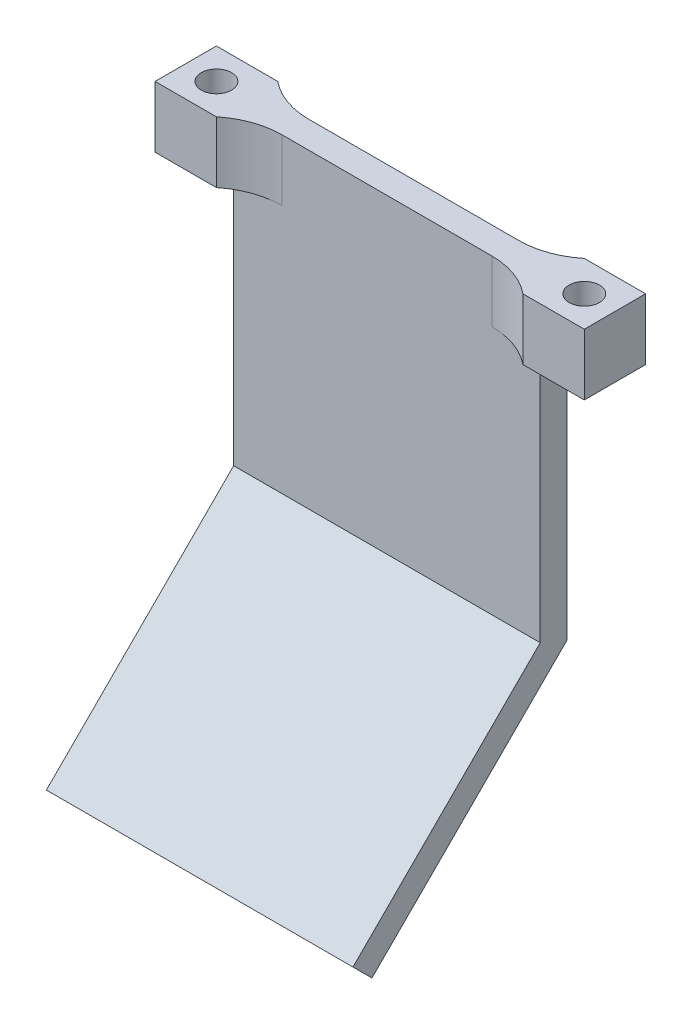
ISO-10303-21;
HEADER;
FILE_DESCRIPTION(('STEP AP214'),'2;1');
FILE_NAME('part.step','',(''),(''),'','','');
FILE_SCHEMA(('AUTOMOTIVE_DESIGN { 1 0 10303 214 1 1 1 1 }'));
ENDSEC;
DATA;
#1=APPLICATION_CONTEXT('core data for automotive mechanical design processes');
#2=APPLICATION_PROTOCOL_DEFINITION('international standard','automotive_design',2000,#1);
#3=PRODUCT_CONTEXT('',#1,'mechanical');
#4=PRODUCT('Part','Part','',(#3));
#5=PRODUCT_RELATED_PRODUCT_CATEGORY('part','',(#4));
#6=PRODUCT_DEFINITION_FORMATION('','',#4);
#7=PRODUCT_DEFINITION_CONTEXT('part definition',#1,'design');
#8=PRODUCT_DEFINITION('design','',#6,#7);
#9=PRODUCT_DEFINITION_SHAPE('','',#8);
#10=(LENGTH_UNIT() NAMED_UNIT(*) SI_UNIT(.MILLI.,.METRE.));
#11=(NAMED_UNIT(*) PLANE_ANGLE_UNIT() SI_UNIT($,.RADIAN.));
#12=(NAMED_UNIT(*) SI_UNIT($,.STERADIAN.) SOLID_ANGLE_UNIT());
#13=UNCERTAINTY_MEASURE_WITH_UNIT(LENGTH_MEASURE(1.E-05),#10,'distance_accuracy_value','');
#14=(GEOMETRIC_REPRESENTATION_CONTEXT(3) GLOBAL_UNCERTAINTY_ASSIGNED_CONTEXT((#13)) GLOBAL_UNIT_ASSIGNED_CONTEXT((#10,
#11,#12)) REPRESENTATION_CONTEXT('',''));
#15=CARTESIAN_POINT('',(0.,0.,0.));
#16=DIRECTION('',(0.,0.,1.));
#17=DIRECTION('',(1.,0.,0.));
#18=AXIS2_PLACEMENT_3D('',#15,#16,#17);
#19=CARTESIAN_POINT('',(40.,0.,0.));
#20=DIRECTION('',(-1.,0.,0.));
#21=DIRECTION('',(0.,0.,1.));
#22=AXIS2_PLACEMENT_3D('',#19,#20,#21);
#23=PLANE('',#22);
#24=DIRECTION('',(0.,0.,-1.));
#25=VECTOR('',#24,1.);
#26=CARTESIAN_POINT('',(40.,-8.,5.75));
#27=LINE('',#26,#25);
#28=CARTESIAN_POINT('',(40.,-8.,3.5));
#29=VERTEX_POINT('',#28);
#30=CARTESIAN_POINT('',(40.,-8.,0.));
#31=VERTEX_POINT('',#30);
#32=EDGE_CURVE('E329',#29,#31,#27,.T.);
#33=ORIENTED_EDGE('',*,*,#32,.F.);
#34=DIRECTION('',(0.,-1.,0.));
#35=VECTOR('',#34,1.);
#36=CARTESIAN_POINT('',(40.,0.,3.5));
#37=LINE('',#36,#35);
#38=CARTESIAN_POINT('',(40.,-40.5502525316942,3.5));
#39=VERTEX_POINT('',#38);
#40=EDGE_CURVE('E250',#29,#39,#37,.T.);
#41=ORIENTED_EDGE('',*,*,#40,.T.);
#42=DIRECTION('',(0.,-0.707106781186548,0.707106781186548));
#43=VECTOR('',#42,1.);
#44=CARTESIAN_POINT('',(40.,-40.5502525316942,3.5));
#45=LINE('',#44,#43);
#46=CARTESIAN_POINT('',(40.,-64.9809703885628,27.9307178568686));
#47=VERTEX_POINT('',#46);
#48=EDGE_CURVE('E253',#39,#47,#45,.T.);
#49=ORIENTED_EDGE('',*,*,#48,.T.);
#50=DIRECTION('',(0.,-0.707106781186549,-0.707106781186546));
#51=VECTOR('',#50,1.);
#52=CARTESIAN_POINT('',(40.,-64.9809703885628,27.9307178568686));
#53=LINE('',#52,#51);
#54=CARTESIAN_POINT('',(40.,-67.4558441227157,25.4558441227157));
#55=VERTEX_POINT('',#54);
#56=EDGE_CURVE('E257',#47,#55,#53,.T.);
#57=ORIENTED_EDGE('',*,*,#56,.T.);
#58=DIRECTION('',(0.,0.707106781186547,-0.707106781186547));
#59=VECTOR('',#58,1.);
#60=CARTESIAN_POINT('',(40.,-42.,0.));
#61=LINE('',#60,#59);
#62=CARTESIAN_POINT('',(40.,-42.,0.));
#63=VERTEX_POINT('',#62);
#64=EDGE_CURVE('E260',#55,#63,#61,.T.);
#65=ORIENTED_EDGE('',*,*,#64,.T.);
#66=DIRECTION('',(0.,1.,0.));
#67=VECTOR('',#66,1.);
#68=CARTESIAN_POINT('',(40.,0.,0.));
#69=LINE('',#68,#67);
#70=EDGE_CURVE('E263',#63,#31,#69,.T.);
#71=ORIENTED_EDGE('',*,*,#70,.T.);
#72=EDGE_LOOP('',(#33,#41,#49,#57,#65,#71));
#73=FACE_BOUND('',#72,.T.);
#74=ADVANCED_FACE('F45',(#73),#23,.F.);
#75=CARTESIAN_POINT('',(40.,0.,3.5));
#76=DIRECTION('',(0.,-1.,0.));
#77=DIRECTION('',(0.,0.,-1.));
#78=AXIS2_PLACEMENT_3D('',#75,#76,#77);
#79=PLANE('',#78);
#80=CARTESIAN_POINT('',(44.,0.,1.75));
#81=DIRECTION('',(0.,1.,0.));
#82=DIRECTION('',(0.,0.,1.));
#83=AXIS2_PLACEMENT_3D('',#80,#81,#82);
#84=CIRCLE('',#83,1.98);
#85=CARTESIAN_POINT('',(44.,0.,3.73));
#86=VERTEX_POINT('',#85);
#87=EDGE_CURVE('E413',#86,#86,#84,.T.);
#88=ORIENTED_EDGE('',*,*,#87,.F.);
#89=EDGE_LOOP('',(#88));
#90=FACE_BOUND('',#89,.T.);
#91=CARTESIAN_POINT('',(-4.,0.,1.75));
#92=DIRECTION('',(0.,1.,0.));
#93=DIRECTION('',(0.,0.,1.));
#94=AXIS2_PLACEMENT_3D('',#91,#92,#93);
#95=CIRCLE('',#94,1.98);
#96=CARTESIAN_POINT('',(-4.,0.,3.73));
#97=VERTEX_POINT('',#96);
#98=EDGE_CURVE('E194',#97,#97,#95,.T.);
#99=ORIENTED_EDGE('',*,*,#98,.F.);
#100=EDGE_LOOP('',(#99));
#101=FACE_BOUND('',#100,.T.);
#102=DIRECTION('',(-1.,0.,0.));
#103=VECTOR('',#102,1.);
#104=CARTESIAN_POINT('',(48.,0.,-2.25));
#105=LINE('',#104,#103);
#106=CARTESIAN_POINT('',(48.,0.,-2.25));
#107=VERTEX_POINT('',#106);
#108=CARTESIAN_POINT('',(40.,0.,-2.25));
#109=VERTEX_POINT('',#108);
#110=EDGE_CURVE('E201',#107,#109,#105,.T.);
#111=ORIENTED_EDGE('',*,*,#110,.T.);
#112=CARTESIAN_POINT('',(33.6803876701177,0.,-10.));
#113=DIRECTION('',(0.,-1.,0.));
#114=DIRECTION('',(0.,0.,-1.));
#115=AXIS2_PLACEMENT_3D('',#112,#113,#114);
#116=CIRCLE('',#115,10.);
#117=CARTESIAN_POINT('',(33.6803876701177,0.,0.));
#118=VERTEX_POINT('',#117);
#119=EDGE_CURVE('E337',#109,#118,#116,.T.);
#120=ORIENTED_EDGE('',*,*,#119,.T.);
#121=DIRECTION('',(-1.,0.,0.));
#122=VECTOR('',#121,1.);
#123=CARTESIAN_POINT('',(40.,0.,0.));
#124=LINE('',#123,#122);
#125=CARTESIAN_POINT('',(6.31961232988227,0.,0.));
#126=VERTEX_POINT('',#125);
#127=EDGE_CURVE('E267',#118,#126,#124,.T.);
#128=ORIENTED_EDGE('',*,*,#127,.T.);
#129=CARTESIAN_POINT('',(6.31961232988227,0.,-10.));
#130=DIRECTION('',(0.,-1.,0.));
#131=DIRECTION('',(0.,0.,-1.));
#132=AXIS2_PLACEMENT_3D('',#129,#130,#131);
#133=CIRCLE('',#132,10.);
#134=CARTESIAN_POINT('',(0.,0.,-2.25));
#135=VERTEX_POINT('',#134);
#136=EDGE_CURVE('E309',#126,#135,#133,.T.);
#137=ORIENTED_EDGE('',*,*,#136,.T.);
#138=DIRECTION('',(1.,0.,0.));
#139=VECTOR('',#138,1.);
#140=CARTESIAN_POINT('',(-8.,0.,-2.25));
#141=LINE('',#140,#139);
#142=CARTESIAN_POINT('',(-8.,0.,-2.25));
#143=VERTEX_POINT('',#142);
#144=EDGE_CURVE('E242',#143,#135,#141,.T.);
#145=ORIENTED_EDGE('',*,*,#144,.F.);
#146=DIRECTION('',(0.,0.,-1.));
#147=VECTOR('',#146,1.);
#148=CARTESIAN_POINT('',(-8.,0.,-2.25));
#149=LINE('',#148,#147);
#150=CARTESIAN_POINT('',(-8.,0.,5.75));
#151=VERTEX_POINT('',#150);
#152=EDGE_CURVE('E213',#151,#143,#149,.T.);
#153=ORIENTED_EDGE('',*,*,#152,.F.);
#154=DIRECTION('',(1.,0.,0.));
#155=VECTOR('',#154,1.);
#156=CARTESIAN_POINT('',(-8.,0.,5.75));
#157=LINE('',#156,#155);
#158=CARTESIAN_POINT('',(0.,0.,5.75));
#159=VERTEX_POINT('',#158);
#160=EDGE_CURVE('E246',#151,#159,#157,.T.);
#161=ORIENTED_EDGE('',*,*,#160,.T.);
#162=CARTESIAN_POINT('',(6.31961232988227,0.,13.5));
#163=DIRECTION('',(0.,-1.,0.));
#164=DIRECTION('',(0.,0.,-1.));
#165=AXIS2_PLACEMENT_3D('',#162,#163,#164);
#166=CIRCLE('',#165,10.);
#167=CARTESIAN_POINT('',(6.31961232988227,0.,3.5));
#168=VERTEX_POINT('',#167);
#169=EDGE_CURVE('E325',#159,#168,#166,.T.);
#170=ORIENTED_EDGE('',*,*,#169,.T.);
#171=DIRECTION('',(-1.,0.,0.));
#172=VECTOR('',#171,1.);
#173=CARTESIAN_POINT('',(40.,0.,3.5));
#174=LINE('',#173,#172);
#175=CARTESIAN_POINT('',(33.6803876701177,0.,3.5));
#176=VERTEX_POINT('',#175);
#177=EDGE_CURVE('E234',#176,#168,#174,.T.);
#178=ORIENTED_EDGE('',*,*,#177,.F.);
#179=CARTESIAN_POINT('',(33.6803876701177,0.,13.5));
#180=DIRECTION('',(0.,-1.,0.));
#181=DIRECTION('',(0.,0.,-1.));
#182=AXIS2_PLACEMENT_3D('',#179,#180,#181);
#183=CIRCLE('',#182,10.);
#184=CARTESIAN_POINT('',(40.,0.,5.75));
#185=VERTEX_POINT('',#184);
#186=EDGE_CURVE('E11',#176,#185,#183,.T.);
#187=ORIENTED_EDGE('',*,*,#186,.T.);
#188=DIRECTION('',(-1.,0.,0.));
#189=VECTOR('',#188,1.);
#190=CARTESIAN_POINT('',(48.,0.,5.75));
#191=LINE('',#190,#189);
#192=CARTESIAN_POINT('',(48.,0.,5.75));
#193=VERTEX_POINT('',#192);
#194=EDGE_CURVE('E357',#193,#185,#191,.T.);
#195=ORIENTED_EDGE('',*,*,#194,.F.);
#196=DIRECTION('',(0.,0.,1.));
#197=VECTOR('',#196,1.);
#198=CARTESIAN_POINT('',(48.,0.,5.75));
#199=LINE('',#198,#197);
#200=EDGE_CURVE('E183',#107,#193,#199,.T.);
#201=ORIENTED_EDGE('',*,*,#200,.F.);
#202=EDGE_LOOP('',(#111,#120,#128,#137,#145,#153,#161,#170,#178,#187,#195,#201));
#203=FACE_BOUND('',#202,.T.);
#204=ADVANCED_FACE('F363',(#90,#101,#203),#79,.F.);
#205=CARTESIAN_POINT('',(40.,0.,3.5));
#206=DIRECTION('',(0.,0.,-1.));
#207=DIRECTION('',(-1.,0.,0.));
#208=AXIS2_PLACEMENT_3D('',#205,#206,#207);
#209=PLANE('',#208);
#210=ORIENTED_EDGE('',*,*,#40,.F.);
#211=DIRECTION('',(-1.,0.,0.));
#212=VECTOR('',#211,1.);
#213=CARTESIAN_POINT('',(48.,-8.,3.5));
#214=LINE('',#213,#212);
#215=CARTESIAN_POINT('',(33.6803876701177,-8.,3.5));
#216=VERTEX_POINT('',#215);
#217=EDGE_CURVE('E61',#29,#216,#214,.T.);
#218=ORIENTED_EDGE('',*,*,#217,.T.);
#219=DIRECTION('',(0.,1.,0.));
#220=VECTOR('',#219,1.);
#221=CARTESIAN_POINT('',(33.6803876701177,0.,3.5));
#222=LINE('',#221,#220);
#223=EDGE_CURVE('E343',#216,#176,#222,.T.);
#224=ORIENTED_EDGE('',*,*,#223,.T.);
#225=ORIENTED_EDGE('',*,*,#177,.T.);
#226=DIRECTION('',(0.,-1.,0.));
#227=VECTOR('',#226,1.);
#228=CARTESIAN_POINT('',(6.31961232988227,0.,3.5));
#229=LINE('',#228,#227);
#230=CARTESIAN_POINT('',(6.31961232988227,-8.,3.5));
#231=VERTEX_POINT('',#230);
#232=EDGE_CURVE('E318',#168,#231,#229,.T.);
#233=ORIENTED_EDGE('',*,*,#232,.T.);
#234=DIRECTION('',(-1.,0.,0.));
#235=VECTOR('',#234,1.);
#236=CARTESIAN_POINT('',(-8.,-8.,3.5));
#237=LINE('',#236,#235);
#238=CARTESIAN_POINT('',(0.,-8.,3.5));
#239=VERTEX_POINT('',#238);
#240=EDGE_CURVE('E315',#231,#239,#237,.T.);
#241=ORIENTED_EDGE('',*,*,#240,.T.);
#242=DIRECTION('',(0.,-1.,0.));
#243=VECTOR('',#242,1.);
#244=CARTESIAN_POINT('',(0.,0.,3.5));
#245=LINE('',#244,#243);
#246=CARTESIAN_POINT('',(0.,-40.5502525316942,3.5));
#247=VERTEX_POINT('',#246);
#248=EDGE_CURVE('E249',#239,#247,#245,.T.);
#249=ORIENTED_EDGE('',*,*,#248,.T.);
#250=DIRECTION('',(-1.,0.,0.));
#251=VECTOR('',#250,1.);
#252=CARTESIAN_POINT('',(40.,-40.5502525316942,3.5));
#253=LINE('',#252,#251);
#254=EDGE_CURVE('E296',#39,#247,#253,.T.);
#255=ORIENTED_EDGE('',*,*,#254,.F.);
#256=EDGE_LOOP('',(#210,#218,#224,#225,#233,#241,#249,#255));
#257=FACE_BOUND('',#256,.T.);
#258=ADVANCED_FACE('F404',(#257),#209,.F.);
#259=CARTESIAN_POINT('',(40.,-40.5502525316942,3.5));
#260=DIRECTION('',(0.,-0.707106781186548,-0.707106781186548));
#261=DIRECTION('',(0.,0.707106781186548,-0.707106781186548));
#262=AXIS2_PLACEMENT_3D('',#259,#260,#261);
#263=PLANE('',#262);
#264=DIRECTION('',(0.,-0.707106781186548,0.707106781186548));
#265=VECTOR('',#264,1.);
#266=CARTESIAN_POINT('',(0.,-40.5502525316942,3.5));
#267=LINE('',#266,#265);
#268=CARTESIAN_POINT('',(0.,-64.9809703885628,27.9307178568686));
#269=VERTEX_POINT('',#268);
#270=EDGE_CURVE('E270',#247,#269,#267,.T.);
#271=ORIENTED_EDGE('',*,*,#270,.T.);
#272=DIRECTION('',(-1.,0.,0.));
#273=VECTOR('',#272,1.);
#274=CARTESIAN_POINT('',(40.,-64.9809703885628,27.9307178568686));
#275=LINE('',#274,#273);
#276=EDGE_CURVE('E292',#47,#269,#275,.T.);
#277=ORIENTED_EDGE('',*,*,#276,.F.);
#278=ORIENTED_EDGE('',*,*,#48,.F.);
#279=ORIENTED_EDGE('',*,*,#254,.T.);
#280=EDGE_LOOP('',(#271,#277,#278,#279));
#281=FACE_BOUND('',#280,.T.);
#282=ADVANCED_FACE('F468',(#281),#263,.F.);
#283=CARTESIAN_POINT('',(40.,-64.9809703885628,27.9307178568686));
#284=DIRECTION('',(0.,0.707106781186546,-0.707106781186549));
#285=DIRECTION('',(0.,0.707106781186549,0.707106781186546));
#286=AXIS2_PLACEMENT_3D('',#283,#284,#285);
#287=PLANE('',#286);
#288=DIRECTION('',(0.,-0.707106781186549,-0.707106781186546));
#289=VECTOR('',#288,1.);
#290=CARTESIAN_POINT('',(0.,-64.9809703885628,27.9307178568686));
#291=LINE('',#290,#289);
#292=CARTESIAN_POINT('',(0.,-67.4558441227157,25.4558441227157));
#293=VERTEX_POINT('',#292);
#294=EDGE_CURVE('E273',#269,#293,#291,.T.);
#295=ORIENTED_EDGE('',*,*,#294,.T.);
#296=DIRECTION('',(-1.,0.,0.));
#297=VECTOR('',#296,1.);
#298=CARTESIAN_POINT('',(40.,-67.4558441227157,25.4558441227157));
#299=LINE('',#298,#297);
#300=EDGE_CURVE('E288',#55,#293,#299,.T.);
#301=ORIENTED_EDGE('',*,*,#300,.F.);
#302=ORIENTED_EDGE('',*,*,#56,.F.);
#303=ORIENTED_EDGE('',*,*,#276,.T.);
#304=EDGE_LOOP('',(#295,#301,#302,#303));
#305=FACE_BOUND('',#304,.T.);
#306=ADVANCED_FACE('F464',(#305),#287,.F.);
#307=CARTESIAN_POINT('',(40.,-42.,0.));
#308=DIRECTION('',(0.,0.707106781186548,0.707106781186548));
#309=DIRECTION('',(0.,-0.707106781186548,0.707106781186548));
#310=AXIS2_PLACEMENT_3D('',#307,#308,#309);
#311=PLANE('',#310);
#312=DIRECTION('',(0.,0.707106781186547,-0.707106781186547));
#313=VECTOR('',#312,1.);
#314=CARTESIAN_POINT('',(0.,-42.,0.));
#315=LINE('',#314,#313);
#316=CARTESIAN_POINT('',(0.,-42.,0.));
#317=VERTEX_POINT('',#316);
#318=EDGE_CURVE('E276',#293,#317,#315,.T.);
#319=ORIENTED_EDGE('',*,*,#318,.T.);
#320=DIRECTION('',(-1.,0.,0.));
#321=VECTOR('',#320,1.);
#322=CARTESIAN_POINT('',(40.,-42.,0.));
#323=LINE('',#322,#321);
#324=EDGE_CURVE('E284',#63,#317,#323,.T.);
#325=ORIENTED_EDGE('',*,*,#324,.F.);
#326=ORIENTED_EDGE('',*,*,#64,.F.);
#327=ORIENTED_EDGE('',*,*,#300,.T.);
#328=EDGE_LOOP('',(#319,#325,#326,#327));
#329=FACE_BOUND('',#328,.T.);
#330=ADVANCED_FACE('F461',(#329),#311,.F.);
#331=CARTESIAN_POINT('',(40.,0.,0.));
#332=DIRECTION('',(0.,0.,1.));
#333=DIRECTION('',(0.,-1.,0.));
#334=AXIS2_PLACEMENT_3D('',#331,#332,#333);
#335=PLANE('',#334);
#336=ORIENTED_EDGE('',*,*,#127,.F.);
#337=DIRECTION('',(0.,-1.,0.));
#338=VECTOR('',#337,1.);
#339=CARTESIAN_POINT('',(33.6803876701177,0.,0.));
#340=LINE('',#339,#338);
#341=CARTESIAN_POINT('',(33.6803876701177,-8.,0.));
#342=VERTEX_POINT('',#341);
#343=EDGE_CURVE('E333',#118,#342,#340,.T.);
#344=ORIENTED_EDGE('',*,*,#343,.T.);
#345=DIRECTION('',(1.,0.,0.));
#346=VECTOR('',#345,1.);
#347=CARTESIAN_POINT('',(48.,-8.,0.));
#348=LINE('',#347,#346);
#349=EDGE_CURVE('E330',#342,#31,#348,.T.);
#350=ORIENTED_EDGE('',*,*,#349,.T.);
#351=ORIENTED_EDGE('',*,*,#70,.F.);
#352=ORIENTED_EDGE('',*,*,#324,.T.);
#353=DIRECTION('',(0.,1.,0.));
#354=VECTOR('',#353,1.);
#355=CARTESIAN_POINT('',(0.,0.,0.));
#356=LINE('',#355,#354);
#357=CARTESIAN_POINT('',(0.,-8.,0.));
#358=VERTEX_POINT('',#357);
#359=EDGE_CURVE('E254',#317,#358,#356,.T.);
#360=ORIENTED_EDGE('',*,*,#359,.T.);
#361=DIRECTION('',(1.,0.,0.));
#362=VECTOR('',#361,1.);
#363=CARTESIAN_POINT('',(-8.,-8.,0.));
#364=LINE('',#363,#362);
#365=CARTESIAN_POINT('',(6.31961232988227,-8.,0.));
#366=VERTEX_POINT('',#365);
#367=EDGE_CURVE('E233',#358,#366,#364,.T.);
#368=ORIENTED_EDGE('',*,*,#367,.T.);
#369=DIRECTION('',(0.,1.,0.));
#370=VECTOR('',#369,1.);
#371=CARTESIAN_POINT('',(6.31961232988227,0.,0.));
#372=LINE('',#371,#370);
#373=EDGE_CURVE('E305',#366,#126,#372,.T.);
#374=ORIENTED_EDGE('',*,*,#373,.T.);
#375=EDGE_LOOP('',(#336,#344,#350,#351,#352,#360,#368,#374));
#376=FACE_BOUND('',#375,.T.);
#377=ADVANCED_FACE('F373',(#376),#335,.F.);
#378=CARTESIAN_POINT('',(0.,0.,0.));
#379=DIRECTION('',(-1.,0.,0.));
#380=DIRECTION('',(0.,0.,1.));
#381=AXIS2_PLACEMENT_3D('',#378,#379,#380);
#382=PLANE('',#381);
#383=DIRECTION('',(0.,0.,1.));
#384=VECTOR('',#383,1.);
#385=CARTESIAN_POINT('',(0.,-8.,-2.25));
#386=LINE('',#385,#384);
#387=EDGE_CURVE('E229',#358,#239,#386,.T.);
#388=ORIENTED_EDGE('',*,*,#387,.F.);
#389=ORIENTED_EDGE('',*,*,#359,.F.);
#390=ORIENTED_EDGE('',*,*,#318,.F.);
#391=ORIENTED_EDGE('',*,*,#294,.F.);
#392=ORIENTED_EDGE('',*,*,#270,.F.);
#393=ORIENTED_EDGE('',*,*,#248,.F.);
#394=EDGE_LOOP('',(#388,#389,#390,#391,#392,#393));
#395=FACE_BOUND('',#394,.T.);
#396=ADVANCED_FACE('F455',(#395),#382,.T.);
#397=CARTESIAN_POINT('',(-8.,0.,5.75));
#398=DIRECTION('',(0.,0.,-1.));
#399=DIRECTION('',(-1.,0.,0.));
#400=AXIS2_PLACEMENT_3D('',#397,#398,#399);
#401=PLANE('',#400);
#402=DIRECTION('',(0.,1.,0.));
#403=VECTOR('',#402,1.);
#404=CARTESIAN_POINT('',(0.,0.,5.75));
#405=LINE('',#404,#403);
#406=CARTESIAN_POINT('',(0.,-8.,5.75));
#407=VERTEX_POINT('',#406);
#408=EDGE_CURVE('E207',#407,#159,#405,.T.);
#409=ORIENTED_EDGE('',*,*,#408,.T.);
#410=ORIENTED_EDGE('',*,*,#160,.F.);
#411=DIRECTION('',(0.,1.,0.));
#412=VECTOR('',#411,1.);
#413=CARTESIAN_POINT('',(-8.,0.,5.75));
#414=LINE('',#413,#412);
#415=CARTESIAN_POINT('',(-8.,-8.,5.75));
#416=VERTEX_POINT('',#415);
#417=EDGE_CURVE('E209',#416,#151,#414,.T.);
#418=ORIENTED_EDGE('',*,*,#417,.F.);
#419=DIRECTION('',(1.,0.,0.));
#420=VECTOR('',#419,1.);
#421=CARTESIAN_POINT('',(-8.,-8.,5.75));
#422=LINE('',#421,#420);
#423=EDGE_CURVE('E223',#416,#407,#422,.T.);
#424=ORIENTED_EDGE('',*,*,#423,.T.);
#425=EDGE_LOOP('',(#409,#410,#418,#424));
#426=FACE_BOUND('',#425,.T.);
#427=ADVANCED_FACE('F399',(#426),#401,.F.);
#428=CARTESIAN_POINT('',(-8.,0.,-2.25));
#429=DIRECTION('',(0.,0.,1.));
#430=DIRECTION('',(0.,-1.,0.));
#431=AXIS2_PLACEMENT_3D('',#428,#429,#430);
#432=PLANE('',#431);
#433=DIRECTION('',(0.,-1.,0.));
#434=VECTOR('',#433,1.);
#435=CARTESIAN_POINT('',(0.,0.,-2.25));
#436=LINE('',#435,#434);
#437=CARTESIAN_POINT('',(0.,-8.,-2.25));
#438=VERTEX_POINT('',#437);
#439=EDGE_CURVE('E214',#135,#438,#436,.T.);
#440=ORIENTED_EDGE('',*,*,#439,.T.);
#441=DIRECTION('',(1.,0.,0.));
#442=VECTOR('',#441,1.);
#443=CARTESIAN_POINT('',(-8.,-8.,-2.25));
#444=LINE('',#443,#442);
#445=CARTESIAN_POINT('',(-8.,-8.,-2.25));
#446=VERTEX_POINT('',#445);
#447=EDGE_CURVE('E238',#446,#438,#444,.T.);
#448=ORIENTED_EDGE('',*,*,#447,.F.);
#449=DIRECTION('',(0.,-1.,0.));
#450=VECTOR('',#449,1.);
#451=CARTESIAN_POINT('',(-8.,0.,-2.25));
#452=LINE('',#451,#450);
#453=EDGE_CURVE('E217',#143,#446,#452,.T.);
#454=ORIENTED_EDGE('',*,*,#453,.F.);
#455=ORIENTED_EDGE('',*,*,#144,.T.);
#456=EDGE_LOOP('',(#440,#448,#454,#455));
#457=FACE_BOUND('',#456,.T.);
#458=ADVANCED_FACE('F384',(#457),#432,.F.);
#459=CARTESIAN_POINT('',(-8.,-8.,-2.25));
#460=DIRECTION('',(0.,1.,0.));
#461=DIRECTION('',(0.,0.,1.));
#462=AXIS2_PLACEMENT_3D('',#459,#460,#461);
#463=PLANE('',#462);
#464=CARTESIAN_POINT('',(-4.,-8.,1.75));
#465=DIRECTION('',(0.,1.,0.));
#466=DIRECTION('',(0.,0.,1.));
#467=AXIS2_PLACEMENT_3D('',#464,#465,#466);
#468=CIRCLE('',#467,1.98);
#469=CARTESIAN_POINT('',(-4.,-8.,3.73));
#470=VERTEX_POINT('',#469);
#471=EDGE_CURVE('E199',#470,#470,#468,.T.);
#472=ORIENTED_EDGE('',*,*,#471,.T.);
#473=EDGE_LOOP('',(#472));
#474=FACE_BOUND('',#473,.T.);
#475=ORIENTED_EDGE('',*,*,#447,.T.);
#476=CARTESIAN_POINT('',(6.31961232988227,-8.,-10.));
#477=DIRECTION('',(0.,1.,0.));
#478=DIRECTION('',(0.,0.,1.));
#479=AXIS2_PLACEMENT_3D('',#476,#477,#478);
#480=CIRCLE('',#479,10.);
#481=EDGE_CURVE('E312',#438,#366,#480,.T.);
#482=ORIENTED_EDGE('',*,*,#481,.T.);
#483=ORIENTED_EDGE('',*,*,#367,.F.);
#484=ORIENTED_EDGE('',*,*,#387,.T.);
#485=ORIENTED_EDGE('',*,*,#240,.F.);
#486=CARTESIAN_POINT('',(6.31961232988227,-8.,13.5));
#487=DIRECTION('',(0.,1.,0.));
#488=DIRECTION('',(0.,0.,1.));
#489=AXIS2_PLACEMENT_3D('',#486,#487,#488);
#490=CIRCLE('',#489,10.);
#491=EDGE_CURVE('E322',#231,#407,#490,.T.);
#492=ORIENTED_EDGE('',*,*,#491,.T.);
#493=ORIENTED_EDGE('',*,*,#423,.F.);
#494=DIRECTION('',(0.,0.,1.));
#495=VECTOR('',#494,1.);
#496=CARTESIAN_POINT('',(-8.,-8.,-2.25));
#497=LINE('',#496,#495);
#498=EDGE_CURVE('E220',#446,#416,#497,.T.);
#499=ORIENTED_EDGE('',*,*,#498,.F.);
#500=EDGE_LOOP('',(#475,#482,#483,#484,#485,#492,#493,#499));
#501=FACE_BOUND('',#500,.T.);
#502=ADVANCED_FACE('F388',(#474,#501),#463,.F.);
#503=CARTESIAN_POINT('',(-8.,0.,0.));
#504=DIRECTION('',(-1.,0.,0.));
#505=DIRECTION('',(0.,0.,1.));
#506=AXIS2_PLACEMENT_3D('',#503,#504,#505);
#507=PLANE('',#506);
#508=ORIENTED_EDGE('',*,*,#417,.T.);
#509=ORIENTED_EDGE('',*,*,#152,.T.);
#510=ORIENTED_EDGE('',*,*,#453,.T.);
#511=ORIENTED_EDGE('',*,*,#498,.T.);
#512=EDGE_LOOP('',(#508,#509,#510,#511));
#513=FACE_BOUND('',#512,.T.);
#514=ADVANCED_FACE('F392',(#513),#507,.T.);
#515=CARTESIAN_POINT('',(-4.,-8.,1.75));
#516=DIRECTION('',(0.,1.,0.));
#517=DIRECTION('',(0.,0.,1.));
#518=AXIS2_PLACEMENT_3D('',#515,#516,#517);
#519=CYLINDRICAL_SURFACE('',#518,1.98);
#520=ORIENTED_EDGE('',*,*,#471,.F.);
#521=EDGE_LOOP('',(#520));
#522=FACE_BOUND('',#521,.T.);
#523=ORIENTED_EDGE('',*,*,#98,.T.);
#524=EDGE_LOOP('',(#523));
#525=FACE_BOUND('',#524,.T.);
#526=ADVANCED_FACE('F432',(#522,#525),#519,.F.);
#527=CARTESIAN_POINT('',(6.31961232988227,0.,-10.));
#528=DIRECTION('',(0.,1.,0.));
#529=DIRECTION('',(0.,0.,1.));
#530=AXIS2_PLACEMENT_3D('',#527,#528,#529);
#531=CYLINDRICAL_SURFACE('',#530,10.);
#532=ORIENTED_EDGE('',*,*,#481,.F.);
#533=ORIENTED_EDGE('',*,*,#439,.F.);
#534=ORIENTED_EDGE('',*,*,#136,.F.);
#535=ORIENTED_EDGE('',*,*,#373,.F.);
#536=EDGE_LOOP('',(#532,#533,#534,#535));
#537=FACE_BOUND('',#536,.T.);
#538=ADVANCED_FACE('F381',(#537),#531,.F.);
#539=CARTESIAN_POINT('',(6.31961232988227,0.,13.5));
#540=DIRECTION('',(0.,-1.,0.));
#541=DIRECTION('',(0.,0.,-1.));
#542=AXIS2_PLACEMENT_3D('',#539,#540,#541);
#543=CYLINDRICAL_SURFACE('',#542,10.);
#544=ORIENTED_EDGE('',*,*,#169,.F.);
#545=ORIENTED_EDGE('',*,*,#408,.F.);
#546=ORIENTED_EDGE('',*,*,#491,.F.);
#547=ORIENTED_EDGE('',*,*,#232,.F.);
#548=EDGE_LOOP('',(#544,#545,#546,#547));
#549=FACE_BOUND('',#548,.T.);
#550=ADVANCED_FACE('F401',(#549),#543,.F.);
#551=CARTESIAN_POINT('',(48.,0.,5.75));
#552=DIRECTION('',(0.,0.,-1.));
#553=DIRECTION('',(-1.,0.,0.));
#554=AXIS2_PLACEMENT_3D('',#551,#552,#553);
#555=PLANE('',#554);
#556=DIRECTION('',(0.,-1.,0.));
#557=VECTOR('',#556,1.);
#558=CARTESIAN_POINT('',(40.,0.,5.75));
#559=LINE('',#558,#557);
#560=CARTESIAN_POINT('',(40.,-8.,5.75));
#561=VERTEX_POINT('',#560);
#562=EDGE_CURVE('E192',#185,#561,#559,.T.);
#563=ORIENTED_EDGE('',*,*,#562,.T.);
#564=DIRECTION('',(-1.,0.,0.));
#565=VECTOR('',#564,1.);
#566=CARTESIAN_POINT('',(48.,-8.,5.75));
#567=LINE('',#566,#565);
#568=CARTESIAN_POINT('',(48.,-8.,5.75));
#569=VERTEX_POINT('',#568);
#570=EDGE_CURVE('E170',#569,#561,#567,.T.);
#571=ORIENTED_EDGE('',*,*,#570,.F.);
#572=DIRECTION('',(0.,-1.,0.));
#573=VECTOR('',#572,1.);
#574=CARTESIAN_POINT('',(48.,0.,5.75));
#575=LINE('',#574,#573);
#576=EDGE_CURVE('E178',#193,#569,#575,.T.);
#577=ORIENTED_EDGE('',*,*,#576,.F.);
#578=ORIENTED_EDGE('',*,*,#194,.T.);
#579=EDGE_LOOP('',(#563,#571,#577,#578));
#580=FACE_BOUND('',#579,.T.);
#581=ADVANCED_FACE('F190',(#580),#555,.F.);
#582=CARTESIAN_POINT('',(48.,-8.,5.75));
#583=DIRECTION('',(0.,1.,0.));
#584=DIRECTION('',(0.,0.,1.));
#585=AXIS2_PLACEMENT_3D('',#582,#583,#584);
#586=PLANE('',#585);
#587=CARTESIAN_POINT('',(44.,-8.,1.75));
#588=DIRECTION('',(0.,1.,0.));
#589=DIRECTION('',(0.,0.,1.));
#590=AXIS2_PLACEMENT_3D('',#587,#588,#589);
#591=CIRCLE('',#590,1.98);
#592=CARTESIAN_POINT('',(44.,-8.,3.73));
#593=VERTEX_POINT('',#592);
#594=EDGE_CURVE('E410',#593,#593,#591,.T.);
#595=ORIENTED_EDGE('',*,*,#594,.T.);
#596=EDGE_LOOP('',(#595));
#597=FACE_BOUND('',#596,.T.);
#598=ORIENTED_EDGE('',*,*,#570,.T.);
#599=CARTESIAN_POINT('',(33.6803876701177,-8.,13.5));
#600=DIRECTION('',(0.,1.,0.));
#601=DIRECTION('',(0.,0.,1.));
#602=AXIS2_PLACEMENT_3D('',#599,#600,#601);
#603=CIRCLE('',#602,10.);
#604=EDGE_CURVE('E54',#561,#216,#603,.T.);
#605=ORIENTED_EDGE('',*,*,#604,.T.);
#606=ORIENTED_EDGE('',*,*,#217,.F.);
#607=ORIENTED_EDGE('',*,*,#32,.T.);
#608=ORIENTED_EDGE('',*,*,#349,.F.);
#609=CARTESIAN_POINT('',(33.6803876701177,-8.,-10.));
#610=DIRECTION('',(0.,1.,0.));
#611=DIRECTION('',(0.,0.,1.));
#612=AXIS2_PLACEMENT_3D('',#609,#610,#611);
#613=CIRCLE('',#612,10.);
#614=CARTESIAN_POINT('',(40.,-8.,-2.25));
#615=VERTEX_POINT('',#614);
#616=EDGE_CURVE('E340',#342,#615,#613,.T.);
#617=ORIENTED_EDGE('',*,*,#616,.T.);
#618=DIRECTION('',(-1.,0.,0.));
#619=VECTOR('',#618,1.);
#620=CARTESIAN_POINT('',(48.,-8.,-2.25));
#621=LINE('',#620,#619);
#622=CARTESIAN_POINT('',(48.,-8.,-2.25));
#623=VERTEX_POINT('',#622);
#624=EDGE_CURVE('E173',#623,#615,#621,.T.);
#625=ORIENTED_EDGE('',*,*,#624,.F.);
#626=DIRECTION('',(0.,0.,-1.));
#627=VECTOR('',#626,1.);
#628=CARTESIAN_POINT('',(48.,-8.,5.75));
#629=LINE('',#628,#627);
#630=EDGE_CURVE('E166',#569,#623,#629,.T.);
#631=ORIENTED_EDGE('',*,*,#630,.F.);
#632=EDGE_LOOP('',(#598,#605,#606,#607,#608,#617,#625,#631));
#633=FACE_BOUND('',#632,.T.);
#634=ADVANCED_FACE('F168',(#597,#633),#586,.F.);
#635=CARTESIAN_POINT('',(48.,0.,-2.25));
#636=DIRECTION('',(0.,0.,1.));
#637=DIRECTION('',(1.,0.,0.));
#638=AXIS2_PLACEMENT_3D('',#635,#636,#637);
#639=PLANE('',#638);
#640=DIRECTION('',(0.,1.,0.));
#641=VECTOR('',#640,1.);
#642=CARTESIAN_POINT('',(40.,0.,-2.25));
#643=LINE('',#642,#641);
#644=EDGE_CURVE('E188',#615,#109,#643,.T.);
#645=ORIENTED_EDGE('',*,*,#644,.T.);
#646=ORIENTED_EDGE('',*,*,#110,.F.);
#647=DIRECTION('',(0.,1.,0.));
#648=VECTOR('',#647,1.);
#649=CARTESIAN_POINT('',(48.,0.,-2.25));
#650=LINE('',#649,#648);
#651=EDGE_CURVE('E177',#623,#107,#650,.T.);
#652=ORIENTED_EDGE('',*,*,#651,.F.);
#653=ORIENTED_EDGE('',*,*,#624,.T.);
#654=EDGE_LOOP('',(#645,#646,#652,#653));
#655=FACE_BOUND('',#654,.T.);
#656=ADVANCED_FACE('F366',(#655),#639,.F.);
#657=CARTESIAN_POINT('',(48.,0.,0.));
#658=DIRECTION('',(1.,0.,0.));
#659=DIRECTION('',(0.,0.,-1.));
#660=AXIS2_PLACEMENT_3D('',#657,#658,#659);
#661=PLANE('',#660);
#662=ORIENTED_EDGE('',*,*,#576,.T.);
#663=ORIENTED_EDGE('',*,*,#630,.T.);
#664=ORIENTED_EDGE('',*,*,#651,.T.);
#665=ORIENTED_EDGE('',*,*,#200,.T.);
#666=EDGE_LOOP('',(#662,#663,#664,#665));
#667=FACE_BOUND('',#666,.T.);
#668=ADVANCED_FACE('F181',(#667),#661,.T.);
#669=CARTESIAN_POINT('',(44.,-8.,1.75));
#670=DIRECTION('',(0.,1.,0.));
#671=DIRECTION('',(0.,0.,1.));
#672=AXIS2_PLACEMENT_3D('',#669,#670,#671);
#673=CYLINDRICAL_SURFACE('',#672,1.98);
#674=ORIENTED_EDGE('',*,*,#594,.F.);
#675=EDGE_LOOP('',(#674));
#676=FACE_BOUND('',#675,.T.);
#677=ORIENTED_EDGE('',*,*,#87,.T.);
#678=EDGE_LOOP('',(#677));
#679=FACE_BOUND('',#678,.T.);
#680=ADVANCED_FACE('F425',(#676,#679),#673,.F.);
#681=CARTESIAN_POINT('',(33.6803876701177,0.,-10.));
#682=DIRECTION('',(0.,-1.,0.));
#683=DIRECTION('',(0.,0.,-1.));
#684=AXIS2_PLACEMENT_3D('',#681,#682,#683);
#685=CYLINDRICAL_SURFACE('',#684,10.);
#686=ORIENTED_EDGE('',*,*,#616,.F.);
#687=ORIENTED_EDGE('',*,*,#343,.F.);
#688=ORIENTED_EDGE('',*,*,#119,.F.);
#689=ORIENTED_EDGE('',*,*,#644,.F.);
#690=EDGE_LOOP('',(#686,#687,#688,#689));
#691=FACE_BOUND('',#690,.T.);
#692=ADVANCED_FACE('F370',(#691),#685,.F.);
#693=CARTESIAN_POINT('',(33.6803876701177,0.,13.5));
#694=DIRECTION('',(0.,1.,0.));
#695=DIRECTION('',(0.,0.,1.));
#696=AXIS2_PLACEMENT_3D('',#693,#694,#695);
#697=CYLINDRICAL_SURFACE('',#696,10.);
#698=ORIENTED_EDGE('',*,*,#186,.F.);
#699=ORIENTED_EDGE('',*,*,#223,.F.);
#700=ORIENTED_EDGE('',*,*,#604,.F.);
#701=ORIENTED_EDGE('',*,*,#562,.F.);
#702=EDGE_LOOP('',(#698,#699,#700,#701));
#703=FACE_BOUND('',#702,.T.);
#704=ADVANCED_FACE('F47',(#703),#697,.F.);
#705=CLOSED_SHELL('',(#74,#204,#258,#282,#306,#330,#377,#396,#427,#458,#502,#514,#526,#538,#550,
#581,#634,#656,#668,#680,#692,#704));
#706=MANIFOLD_SOLID_BREP('B2',#705);
#707=ADVANCED_BREP_SHAPE_REPRESENTATION('',(#18,#706),#14);
#708=SHAPE_DEFINITION_REPRESENTATION(#9,#707);
ENDSEC;
END-ISO-10303-21;
